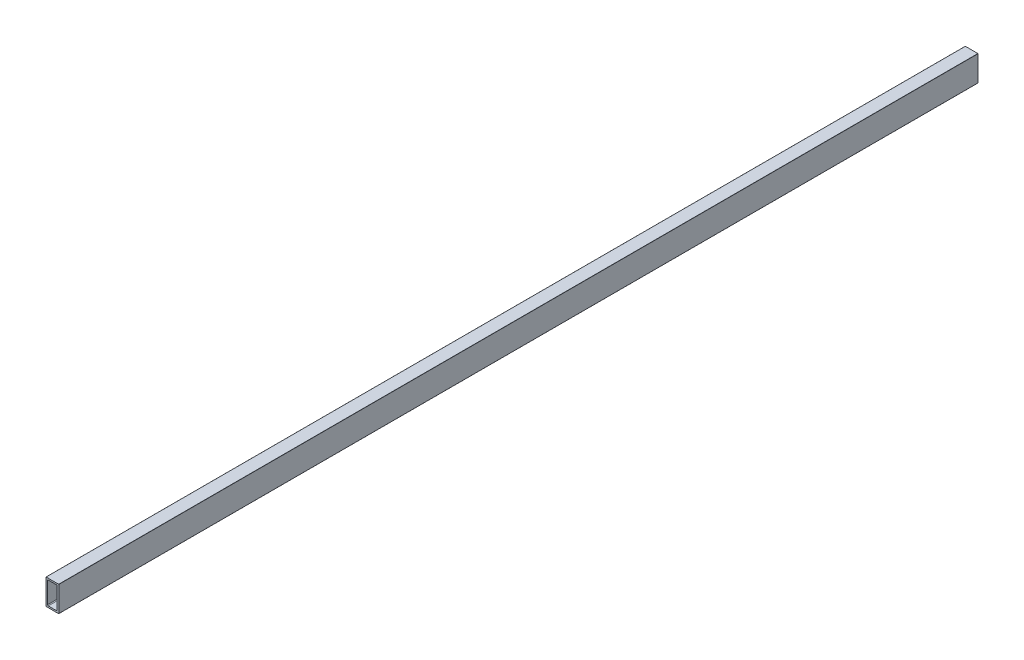
ISO-10303-21;
HEADER;
FILE_DESCRIPTION(('STEP AP214'),'2;1');
FILE_NAME('part.step','',(''),(''),'','','');
FILE_SCHEMA(('AUTOMOTIVE_DESIGN { 1 0 10303 214 1 1 1 1 }'));
ENDSEC;
DATA;
#1=APPLICATION_CONTEXT('core data for automotive mechanical design processes');
#2=APPLICATION_PROTOCOL_DEFINITION('international standard','automotive_design',2000,#1);
#3=PRODUCT_CONTEXT('',#1,'mechanical');
#4=PRODUCT('Part','Part','',(#3));
#5=PRODUCT_RELATED_PRODUCT_CATEGORY('part','',(#4));
#6=PRODUCT_DEFINITION_FORMATION('','',#4);
#7=PRODUCT_DEFINITION_CONTEXT('part definition',#1,'design');
#8=PRODUCT_DEFINITION('design','',#6,#7);
#9=PRODUCT_DEFINITION_SHAPE('','',#8);
#10=(LENGTH_UNIT() NAMED_UNIT(*) SI_UNIT(.MILLI.,.METRE.));
#11=(NAMED_UNIT(*) PLANE_ANGLE_UNIT() SI_UNIT($,.RADIAN.));
#12=(NAMED_UNIT(*) SI_UNIT($,.STERADIAN.) SOLID_ANGLE_UNIT());
#13=UNCERTAINTY_MEASURE_WITH_UNIT(LENGTH_MEASURE(1.E-05),#10,'distance_accuracy_value','');
#14=(GEOMETRIC_REPRESENTATION_CONTEXT(3) GLOBAL_UNCERTAINTY_ASSIGNED_CONTEXT((#13)) GLOBAL_UNIT_ASSIGNED_CONTEXT((#10,
#11,#12)) REPRESENTATION_CONTEXT('',''));
#15=CARTESIAN_POINT('',(0.,0.,0.));
#16=DIRECTION('',(0.,0.,1.));
#17=DIRECTION('',(1.,0.,0.));
#18=AXIS2_PLACEMENT_3D('',#15,#16,#17);
#19=CARTESIAN_POINT('',(3.175,4.7625,1828.8));
#20=DIRECTION('',(1.,0.,0.));
#21=DIRECTION('',(0.,1.,0.));
#22=AXIS2_PLACEMENT_3D('',#19,#20,#21);
#23=PLANE('',#22);
#24=DIRECTION('',(0.,-1.,0.));
#25=VECTOR('',#24,1.);
#26=CARTESIAN_POINT('',(3.175,4.7625,0.));
#27=LINE('',#26,#25);
#28=CARTESIAN_POINT('',(3.175,46.0375,0.));
#29=VERTEX_POINT('',#28);
#30=CARTESIAN_POINT('',(3.175,4.7625,0.));
#31=VERTEX_POINT('',#30);
#32=EDGE_CURVE('E246',#29,#31,#27,.T.);
#33=ORIENTED_EDGE('',*,*,#32,.F.);
#34=DIRECTION('',(0.,0.,-1.));
#35=VECTOR('',#34,1.);
#36=CARTESIAN_POINT('',(3.175,46.0375,1828.8));
#37=LINE('',#36,#35);
#38=CARTESIAN_POINT('',(3.175,46.0375,1828.8));
#39=VERTEX_POINT('',#38);
#40=EDGE_CURVE('E10',#39,#29,#37,.T.);
#41=ORIENTED_EDGE('',*,*,#40,.F.);
#42=DIRECTION('',(0.,-1.,0.));
#43=VECTOR('',#42,1.);
#44=CARTESIAN_POINT('',(3.175,4.7625,1828.8));
#45=LINE('',#44,#43);
#46=CARTESIAN_POINT('',(3.175,4.7625,1828.8));
#47=VERTEX_POINT('',#46);
#48=EDGE_CURVE('E224',#39,#47,#45,.T.);
#49=ORIENTED_EDGE('',*,*,#48,.T.);
#50=DIRECTION('',(0.,0.,-1.));
#51=VECTOR('',#50,1.);
#52=CARTESIAN_POINT('',(3.175,4.7625,1828.8));
#53=LINE('',#52,#51);
#54=EDGE_CURVE('E265',#47,#31,#53,.T.);
#55=ORIENTED_EDGE('',*,*,#54,.T.);
#56=EDGE_LOOP('',(#33,#41,#49,#55));
#57=FACE_BOUND('',#56,.T.);
#58=ADVANCED_FACE('F16',(#57),#23,.T.);
#59=CARTESIAN_POINT('',(4.7625,46.0375,1828.8));
#60=DIRECTION('',(0.,0.,-1.));
#61=DIRECTION('',(-1.,0.,0.));
#62=AXIS2_PLACEMENT_3D('',#59,#60,#61);
#63=CYLINDRICAL_SURFACE('',#62,1.5875);
#64=CARTESIAN_POINT('',(4.7625,46.0375,0.));
#65=DIRECTION('',(0.,0.,1.));
#66=DIRECTION('',(-1.,0.,0.));
#67=AXIS2_PLACEMENT_3D('',#64,#65,#66);
#68=CIRCLE('',#67,1.5875);
#69=CARTESIAN_POINT('',(4.7625,47.625,0.));
#70=VERTEX_POINT('',#69);
#71=EDGE_CURVE('E251',#70,#29,#68,.T.);
#72=ORIENTED_EDGE('',*,*,#71,.F.);
#73=DIRECTION('',(0.,0.,-1.));
#74=VECTOR('',#73,1.);
#75=CARTESIAN_POINT('',(4.7625,47.625,1828.8));
#76=LINE('',#75,#74);
#77=CARTESIAN_POINT('',(4.7625,47.625,1828.8));
#78=VERTEX_POINT('',#77);
#79=EDGE_CURVE('E26',#78,#70,#76,.T.);
#80=ORIENTED_EDGE('',*,*,#79,.F.);
#81=CARTESIAN_POINT('',(4.7625,46.0375,1828.8));
#82=DIRECTION('',(0.,0.,1.));
#83=DIRECTION('',(-1.,0.,0.));
#84=AXIS2_PLACEMENT_3D('',#81,#82,#83);
#85=CIRCLE('',#84,1.5875);
#86=EDGE_CURVE('E215',#78,#39,#85,.T.);
#87=ORIENTED_EDGE('',*,*,#86,.T.);
#88=ORIENTED_EDGE('',*,*,#40,.T.);
#89=EDGE_LOOP('',(#72,#80,#87,#88));
#90=FACE_BOUND('',#89,.T.);
#91=ADVANCED_FACE('F704',(#90),#63,.F.);
#92=CARTESIAN_POINT('',(4.7625,47.625,1828.8));
#93=DIRECTION('',(0.,-1.,0.));
#94=DIRECTION('',(0.,0.,-1.));
#95=AXIS2_PLACEMENT_3D('',#92,#93,#94);
#96=PLANE('',#95);
#97=DIRECTION('',(-1.,0.,0.));
#98=VECTOR('',#97,1.);
#99=CARTESIAN_POINT('',(4.7625,47.625,0.));
#100=LINE('',#99,#98);
#101=CARTESIAN_POINT('',(20.6375,47.625,0.));
#102=VERTEX_POINT('',#101);
#103=EDGE_CURVE('E189',#102,#70,#100,.T.);
#104=ORIENTED_EDGE('',*,*,#103,.F.);
#105=DIRECTION('',(0.,0.,-1.));
#106=VECTOR('',#105,1.);
#107=CARTESIAN_POINT('',(20.6375,47.625,1828.8));
#108=LINE('',#107,#106);
#109=CARTESIAN_POINT('',(20.6375,47.625,1828.8));
#110=VERTEX_POINT('',#109);
#111=EDGE_CURVE('E181',#110,#102,#108,.T.);
#112=ORIENTED_EDGE('',*,*,#111,.F.);
#113=DIRECTION('',(-1.,0.,0.));
#114=VECTOR('',#113,1.);
#115=CARTESIAN_POINT('',(4.7625,47.625,1828.8));
#116=LINE('',#115,#114);
#117=EDGE_CURVE('E212',#110,#78,#116,.T.);
#118=ORIENTED_EDGE('',*,*,#117,.T.);
#119=ORIENTED_EDGE('',*,*,#79,.T.);
#120=EDGE_LOOP('',(#104,#112,#118,#119));
#121=FACE_BOUND('',#120,.T.);
#122=ADVANCED_FACE('F700',(#121),#96,.T.);
#123=CARTESIAN_POINT('',(20.6375,46.0375,1828.8));
#124=DIRECTION('',(0.,0.,-1.));
#125=DIRECTION('',(-1.,0.,0.));
#126=AXIS2_PLACEMENT_3D('',#123,#124,#125);
#127=CYLINDRICAL_SURFACE('',#126,1.5875);
#128=CARTESIAN_POINT('',(20.6375,46.0375,0.));
#129=DIRECTION('',(0.,0.,1.));
#130=DIRECTION('',(-1.,0.,0.));
#131=AXIS2_PLACEMENT_3D('',#128,#129,#130);
#132=CIRCLE('',#131,1.5875);
#133=CARTESIAN_POINT('',(22.225,46.0375,0.));
#134=VERTEX_POINT('',#133);
#135=EDGE_CURVE('E184',#134,#102,#132,.T.);
#136=ORIENTED_EDGE('',*,*,#135,.F.);
#137=DIRECTION('',(0.,0.,-1.));
#138=VECTOR('',#137,1.);
#139=CARTESIAN_POINT('',(22.225,46.0375,1828.8));
#140=LINE('',#139,#138);
#141=CARTESIAN_POINT('',(22.225,46.0375,1828.8));
#142=VERTEX_POINT('',#141);
#143=EDGE_CURVE('E169',#142,#134,#140,.T.);
#144=ORIENTED_EDGE('',*,*,#143,.F.);
#145=CARTESIAN_POINT('',(20.6375,46.0375,1828.8));
#146=DIRECTION('',(0.,0.,1.));
#147=DIRECTION('',(-1.,0.,0.));
#148=AXIS2_PLACEMENT_3D('',#145,#146,#147);
#149=CIRCLE('',#148,1.5875);
#150=EDGE_CURVE('E214',#142,#110,#149,.T.);
#151=ORIENTED_EDGE('',*,*,#150,.T.);
#152=ORIENTED_EDGE('',*,*,#111,.T.);
#153=EDGE_LOOP('',(#136,#144,#151,#152));
#154=FACE_BOUND('',#153,.T.);
#155=ADVANCED_FACE('F185',(#154),#127,.F.);
#156=CARTESIAN_POINT('',(22.225,4.7625,1828.8));
#157=DIRECTION('',(-1.,0.,0.));
#158=DIRECTION('',(0.,0.,1.));
#159=AXIS2_PLACEMENT_3D('',#156,#157,#158);
#160=PLANE('',#159);
#161=DIRECTION('',(0.,1.,0.));
#162=VECTOR('',#161,1.);
#163=CARTESIAN_POINT('',(22.225,4.7625,0.));
#164=LINE('',#163,#162);
#165=CARTESIAN_POINT('',(22.225,4.7625,0.));
#166=VERTEX_POINT('',#165);
#167=EDGE_CURVE('E173',#166,#134,#164,.T.);
#168=ORIENTED_EDGE('',*,*,#167,.F.);
#169=DIRECTION('',(0.,0.,-1.));
#170=VECTOR('',#169,1.);
#171=CARTESIAN_POINT('',(22.225,4.7625,1828.8));
#172=LINE('',#171,#170);
#173=CARTESIAN_POINT('',(22.225,4.7625,1828.8));
#174=VERTEX_POINT('',#173);
#175=EDGE_CURVE('E161',#174,#166,#172,.T.);
#176=ORIENTED_EDGE('',*,*,#175,.F.);
#177=DIRECTION('',(0.,1.,0.));
#178=VECTOR('',#177,1.);
#179=CARTESIAN_POINT('',(22.225,4.7625,1828.8));
#180=LINE('',#179,#178);
#181=EDGE_CURVE('E176',#174,#142,#180,.T.);
#182=ORIENTED_EDGE('',*,*,#181,.T.);
#183=ORIENTED_EDGE('',*,*,#143,.T.);
#184=EDGE_LOOP('',(#168,#176,#182,#183));
#185=FACE_BOUND('',#184,.T.);
#186=ADVANCED_FACE('F171',(#185),#160,.T.);
#187=CARTESIAN_POINT('',(20.6375,4.7625,1828.8));
#188=DIRECTION('',(0.,0.,-1.));
#189=DIRECTION('',(-1.,0.,0.));
#190=AXIS2_PLACEMENT_3D('',#187,#188,#189);
#191=CYLINDRICAL_SURFACE('',#190,1.5875);
#192=CARTESIAN_POINT('',(20.6375,4.7625,0.));
#193=DIRECTION('',(0.,0.,1.));
#194=DIRECTION('',(-1.,0.,0.));
#195=AXIS2_PLACEMENT_3D('',#192,#193,#194);
#196=CIRCLE('',#195,1.5875);
#197=CARTESIAN_POINT('',(20.6375,3.175,0.));
#198=VERTEX_POINT('',#197);
#199=EDGE_CURVE('E195',#198,#166,#196,.T.);
#200=ORIENTED_EDGE('',*,*,#199,.F.);
#201=DIRECTION('',(0.,0.,-1.));
#202=VECTOR('',#201,1.);
#203=CARTESIAN_POINT('',(20.6375,3.175,1828.8));
#204=LINE('',#203,#202);
#205=CARTESIAN_POINT('',(20.6375,3.175,1828.8));
#206=VERTEX_POINT('',#205);
#207=EDGE_CURVE('E266',#206,#198,#204,.T.);
#208=ORIENTED_EDGE('',*,*,#207,.F.);
#209=CARTESIAN_POINT('',(20.6375,4.7625,1828.8));
#210=DIRECTION('',(0.,0.,1.));
#211=DIRECTION('',(-1.,0.,0.));
#212=AXIS2_PLACEMENT_3D('',#209,#210,#211);
#213=CIRCLE('',#212,1.5875);
#214=EDGE_CURVE('E257',#206,#174,#213,.T.);
#215=ORIENTED_EDGE('',*,*,#214,.T.);
#216=ORIENTED_EDGE('',*,*,#175,.T.);
#217=EDGE_LOOP('',(#200,#208,#215,#216));
#218=FACE_BOUND('',#217,.T.);
#219=ADVANCED_FACE('F610',(#218),#191,.F.);
#220=CARTESIAN_POINT('',(4.7625,3.175,1828.8));
#221=DIRECTION('',(0.,1.,0.));
#222=DIRECTION('',(1.,0.,0.));
#223=AXIS2_PLACEMENT_3D('',#220,#221,#222);
#224=PLANE('',#223);
#225=DIRECTION('',(1.,0.,0.));
#226=VECTOR('',#225,1.);
#227=CARTESIAN_POINT('',(4.7625,3.175,0.));
#228=LINE('',#227,#226);
#229=CARTESIAN_POINT('',(4.7625,3.175,0.));
#230=VERTEX_POINT('',#229);
#231=EDGE_CURVE('E202',#230,#198,#228,.T.);
#232=ORIENTED_EDGE('',*,*,#231,.F.);
#233=DIRECTION('',(0.,0.,-1.));
#234=VECTOR('',#233,1.);
#235=CARTESIAN_POINT('',(4.7625,3.175,1828.8));
#236=LINE('',#235,#234);
#237=CARTESIAN_POINT('',(4.7625,3.175,1828.8));
#238=VERTEX_POINT('',#237);
#239=EDGE_CURVE('E269',#238,#230,#236,.T.);
#240=ORIENTED_EDGE('',*,*,#239,.F.);
#241=DIRECTION('',(1.,0.,0.));
#242=VECTOR('',#241,1.);
#243=CARTESIAN_POINT('',(4.7625,3.175,1828.8));
#244=LINE('',#243,#242);
#245=EDGE_CURVE('E321',#238,#206,#244,.T.);
#246=ORIENTED_EDGE('',*,*,#245,.T.);
#247=ORIENTED_EDGE('',*,*,#207,.T.);
#248=EDGE_LOOP('',(#232,#240,#246,#247));
#249=FACE_BOUND('',#248,.T.);
#250=ADVANCED_FACE('F683',(#249),#224,.T.);
#251=CARTESIAN_POINT('',(4.7625,4.7625,1828.8));
#252=DIRECTION('',(0.,0.,-1.));
#253=DIRECTION('',(-1.,0.,0.));
#254=AXIS2_PLACEMENT_3D('',#251,#252,#253);
#255=CYLINDRICAL_SURFACE('',#254,1.5875);
#256=CARTESIAN_POINT('',(4.7625,4.7625,0.));
#257=DIRECTION('',(0.,0.,1.));
#258=DIRECTION('',(1.,0.,0.));
#259=AXIS2_PLACEMENT_3D('',#256,#257,#258);
#260=CIRCLE('',#259,1.5875);
#261=EDGE_CURVE('E248',#31,#230,#260,.T.);
#262=ORIENTED_EDGE('',*,*,#261,.F.);
#263=ORIENTED_EDGE('',*,*,#54,.F.);
#264=CARTESIAN_POINT('',(4.7625,4.7625,1828.8));
#265=DIRECTION('',(0.,0.,1.));
#266=DIRECTION('',(1.,0.,0.));
#267=AXIS2_PLACEMENT_3D('',#264,#265,#266);
#268=CIRCLE('',#267,1.5875);
#269=EDGE_CURVE('E232',#47,#238,#268,.T.);
#270=ORIENTED_EDGE('',*,*,#269,.T.);
#271=ORIENTED_EDGE('',*,*,#239,.T.);
#272=EDGE_LOOP('',(#262,#263,#270,#271));
#273=FACE_BOUND('',#272,.T.);
#274=ADVANCED_FACE('F672',(#273),#255,.F.);
#275=CARTESIAN_POINT('',(0.,0.254,1828.8));
#276=DIRECTION('',(1.,0.,0.));
#277=DIRECTION('',(0.,1.,0.));
#278=AXIS2_PLACEMENT_3D('',#275,#276,#277);
#279=PLANE('',#278);
#280=DIRECTION('',(0.,-1.,0.));
#281=VECTOR('',#280,1.);
#282=CARTESIAN_POINT('',(0.,0.254,0.));
#283=LINE('',#282,#281);
#284=CARTESIAN_POINT('',(0.,50.546,0.));
#285=VERTEX_POINT('',#284);
#286=CARTESIAN_POINT('',(0.,0.254,0.));
#287=VERTEX_POINT('',#286);
#288=EDGE_CURVE('E270',#285,#287,#283,.T.);
#289=ORIENTED_EDGE('',*,*,#288,.T.);
#290=DIRECTION('',(0.,0.,-1.));
#291=VECTOR('',#290,1.);
#292=CARTESIAN_POINT('',(0.,0.254,1828.8));
#293=LINE('',#292,#291);
#294=CARTESIAN_POINT('',(0.,0.254,1828.8));
#295=VERTEX_POINT('',#294);
#296=EDGE_CURVE('E278',#295,#287,#293,.T.);
#297=ORIENTED_EDGE('',*,*,#296,.F.);
#298=DIRECTION('',(0.,-1.,0.));
#299=VECTOR('',#298,1.);
#300=CARTESIAN_POINT('',(0.,0.254,1828.8));
#301=LINE('',#300,#299);
#302=CARTESIAN_POINT('',(0.,50.546,1828.8));
#303=VERTEX_POINT('',#302);
#304=EDGE_CURVE('E289',#303,#295,#301,.T.);
#305=ORIENTED_EDGE('',*,*,#304,.F.);
#306=DIRECTION('',(0.,0.,-1.));
#307=VECTOR('',#306,1.);
#308=CARTESIAN_POINT('',(0.,50.546,1828.8));
#309=LINE('',#308,#307);
#310=EDGE_CURVE('E262',#303,#285,#309,.T.);
#311=ORIENTED_EDGE('',*,*,#310,.T.);
#312=EDGE_LOOP('',(#289,#297,#305,#311));
#313=FACE_BOUND('',#312,.T.);
#314=ADVANCED_FACE('F661',(#313),#279,.F.);
#315=CARTESIAN_POINT('',(0.254,50.546,1828.8));
#316=DIRECTION('',(0.,0.,-1.));
#317=DIRECTION('',(-1.,0.,0.));
#318=AXIS2_PLACEMENT_3D('',#315,#316,#317);
#319=CYLINDRICAL_SURFACE('',#318,0.253999999999995);
#320=CARTESIAN_POINT('',(0.254,50.546,0.));
#321=DIRECTION('',(0.,0.,1.));
#322=DIRECTION('',(-1.,0.,0.));
#323=AXIS2_PLACEMENT_3D('',#320,#321,#322);
#324=CIRCLE('',#323,0.253999999999995);
#325=CARTESIAN_POINT('',(0.254,50.8,0.));
#326=VERTEX_POINT('',#325);
#327=EDGE_CURVE('E274',#326,#285,#324,.T.);
#328=ORIENTED_EDGE('',*,*,#327,.T.);
#329=ORIENTED_EDGE('',*,*,#310,.F.);
#330=CARTESIAN_POINT('',(0.254,50.546,1828.8));
#331=DIRECTION('',(0.,0.,1.));
#332=DIRECTION('',(-1.,0.,0.));
#333=AXIS2_PLACEMENT_3D('',#330,#331,#332);
#334=CIRCLE('',#333,0.253999999999995);
#335=CARTESIAN_POINT('',(0.254,50.8,1828.8));
#336=VERTEX_POINT('',#335);
#337=EDGE_CURVE('E302',#336,#303,#334,.T.);
#338=ORIENTED_EDGE('',*,*,#337,.F.);
#339=DIRECTION('',(0.,0.,-1.));
#340=VECTOR('',#339,1.);
#341=CARTESIAN_POINT('',(0.254,50.8,1828.8));
#342=LINE('',#341,#340);
#343=EDGE_CURVE('E259',#336,#326,#342,.T.);
#344=ORIENTED_EDGE('',*,*,#343,.T.);
#345=EDGE_LOOP('',(#328,#329,#338,#344));
#346=FACE_BOUND('',#345,.T.);
#347=ADVANCED_FACE('F656',(#346),#319,.T.);
#348=CARTESIAN_POINT('',(0.254,50.8,1828.8));
#349=DIRECTION('',(0.,-1.,0.));
#350=DIRECTION('',(0.,0.,-1.));
#351=AXIS2_PLACEMENT_3D('',#348,#349,#350);
#352=PLANE('',#351);
#353=DIRECTION('',(-1.,0.,0.));
#354=VECTOR('',#353,1.);
#355=CARTESIAN_POINT('',(0.254,50.8,0.));
#356=LINE('',#355,#354);
#357=CARTESIAN_POINT('',(25.146,50.8,0.));
#358=VERTEX_POINT('',#357);
#359=EDGE_CURVE('E310',#358,#326,#356,.T.);
#360=ORIENTED_EDGE('',*,*,#359,.T.);
#361=ORIENTED_EDGE('',*,*,#343,.F.);
#362=DIRECTION('',(-1.,0.,0.));
#363=VECTOR('',#362,1.);
#364=CARTESIAN_POINT('',(0.254,50.8,1828.8));
#365=LINE('',#364,#363);
#366=CARTESIAN_POINT('',(25.146,50.8,1828.8));
#367=VERTEX_POINT('',#366);
#368=EDGE_CURVE('E315',#367,#336,#365,.T.);
#369=ORIENTED_EDGE('',*,*,#368,.F.);
#370=DIRECTION('',(0.,0.,-1.));
#371=VECTOR('',#370,1.);
#372=CARTESIAN_POINT('',(25.146,50.8,1828.8));
#373=LINE('',#372,#371);
#374=EDGE_CURVE('E238',#367,#358,#373,.T.);
#375=ORIENTED_EDGE('',*,*,#374,.T.);
#376=EDGE_LOOP('',(#360,#361,#369,#375));
#377=FACE_BOUND('',#376,.T.);
#378=ADVANCED_FACE('F660',(#377),#352,.F.);
#379=CARTESIAN_POINT('',(25.146,50.546,1828.8));
#380=DIRECTION('',(0.,0.,-1.));
#381=DIRECTION('',(-1.,0.,0.));
#382=AXIS2_PLACEMENT_3D('',#379,#380,#381);
#383=CYLINDRICAL_SURFACE('',#382,0.253999999999994);
#384=CARTESIAN_POINT('',(25.146,50.546,0.));
#385=DIRECTION('',(0.,0.,1.));
#386=DIRECTION('',(-1.,0.,0.));
#387=AXIS2_PLACEMENT_3D('',#384,#385,#386);
#388=CIRCLE('',#387,0.253999999999994);
#389=CARTESIAN_POINT('',(25.4,50.546,0.));
#390=VERTEX_POINT('',#389);
#391=EDGE_CURVE('E322',#390,#358,#388,.T.);
#392=ORIENTED_EDGE('',*,*,#391,.T.);
#393=ORIENTED_EDGE('',*,*,#374,.F.);
#394=CARTESIAN_POINT('',(25.146,50.546,1828.8));
#395=DIRECTION('',(0.,0.,1.));
#396=DIRECTION('',(-1.,0.,0.));
#397=AXIS2_PLACEMENT_3D('',#394,#395,#396);
#398=CIRCLE('',#397,0.253999999999994);
#399=CARTESIAN_POINT('',(25.4,50.546,1828.8));
#400=VERTEX_POINT('',#399);
#401=EDGE_CURVE('E311',#400,#367,#398,.T.);
#402=ORIENTED_EDGE('',*,*,#401,.F.);
#403=DIRECTION('',(0.,0.,-1.));
#404=VECTOR('',#403,1.);
#405=CARTESIAN_POINT('',(25.4,50.546,1828.8));
#406=LINE('',#405,#404);
#407=EDGE_CURVE('E235',#400,#390,#406,.T.);
#408=ORIENTED_EDGE('',*,*,#407,.T.);
#409=EDGE_LOOP('',(#392,#393,#402,#408));
#410=FACE_BOUND('',#409,.T.);
#411=ADVANCED_FACE('F366',(#410),#383,.T.);
#412=CARTESIAN_POINT('',(25.4,0.254,1828.8));
#413=DIRECTION('',(-1.,0.,0.));
#414=DIRECTION('',(0.,0.,1.));
#415=AXIS2_PLACEMENT_3D('',#412,#413,#414);
#416=PLANE('',#415);
#417=DIRECTION('',(0.,1.,0.));
#418=VECTOR('',#417,1.);
#419=CARTESIAN_POINT('',(25.4,0.254,0.));
#420=LINE('',#419,#418);
#421=CARTESIAN_POINT('',(25.4,0.254,0.));
#422=VERTEX_POINT('',#421);
#423=EDGE_CURVE('E326',#422,#390,#420,.T.);
#424=ORIENTED_EDGE('',*,*,#423,.T.);
#425=ORIENTED_EDGE('',*,*,#407,.F.);
#426=DIRECTION('',(0.,1.,0.));
#427=VECTOR('',#426,1.);
#428=CARTESIAN_POINT('',(25.4,0.254,1828.8));
#429=LINE('',#428,#427);
#430=CARTESIAN_POINT('',(25.4,0.254,1828.8));
#431=VERTEX_POINT('',#430);
#432=EDGE_CURVE('E210',#431,#400,#429,.T.);
#433=ORIENTED_EDGE('',*,*,#432,.F.);
#434=DIRECTION('',(0.,0.,-1.));
#435=VECTOR('',#434,1.);
#436=CARTESIAN_POINT('',(25.4,0.254,1828.8));
#437=LINE('',#436,#435);
#438=EDGE_CURVE('E19',#431,#422,#437,.T.);
#439=ORIENTED_EDGE('',*,*,#438,.T.);
#440=EDGE_LOOP('',(#424,#425,#433,#439));
#441=FACE_BOUND('',#440,.T.);
#442=ADVANCED_FACE('F358',(#441),#416,.F.);
#443=CARTESIAN_POINT('',(25.146,0.254,1828.8));
#444=DIRECTION('',(0.,0.,-1.));
#445=DIRECTION('',(-1.,0.,0.));
#446=AXIS2_PLACEMENT_3D('',#443,#444,#445);
#447=CYLINDRICAL_SURFACE('',#446,0.254);
#448=CARTESIAN_POINT('',(25.146,0.254,0.));
#449=DIRECTION('',(0.,0.,1.));
#450=DIRECTION('',(1.,0.,0.));
#451=AXIS2_PLACEMENT_3D('',#448,#449,#450);
#452=CIRCLE('',#451,0.254);
#453=CARTESIAN_POINT('',(25.146,0.,0.));
#454=VERTEX_POINT('',#453);
#455=EDGE_CURVE('E306',#454,#422,#452,.T.);
#456=ORIENTED_EDGE('',*,*,#455,.T.);
#457=ORIENTED_EDGE('',*,*,#438,.F.);
#458=CARTESIAN_POINT('',(25.146,0.254,1828.8));
#459=DIRECTION('',(0.,0.,1.));
#460=DIRECTION('',(1.,0.,0.));
#461=AXIS2_PLACEMENT_3D('',#458,#459,#460);
#462=CIRCLE('',#461,0.254);
#463=CARTESIAN_POINT('',(25.146,0.,1828.8));
#464=VERTEX_POINT('',#463);
#465=EDGE_CURVE('E207',#464,#431,#462,.T.);
#466=ORIENTED_EDGE('',*,*,#465,.F.);
#467=DIRECTION('',(0.,0.,-1.));
#468=VECTOR('',#467,1.);
#469=CARTESIAN_POINT('',(25.146,0.,1828.8));
#470=LINE('',#469,#468);
#471=EDGE_CURVE('E281',#464,#454,#470,.T.);
#472=ORIENTED_EDGE('',*,*,#471,.T.);
#473=EDGE_LOOP('',(#456,#457,#466,#472));
#474=FACE_BOUND('',#473,.T.);
#475=ADVANCED_FACE('F373',(#474),#447,.T.);
#476=CARTESIAN_POINT('',(0.254,0.,1828.8));
#477=DIRECTION('',(0.,1.,0.));
#478=DIRECTION('',(1.,0.,0.));
#479=AXIS2_PLACEMENT_3D('',#476,#477,#478);
#480=PLANE('',#479);
#481=DIRECTION('',(1.,0.,0.));
#482=VECTOR('',#481,1.);
#483=CARTESIAN_POINT('',(0.254,0.,0.));
#484=LINE('',#483,#482);
#485=CARTESIAN_POINT('',(0.254,0.,0.));
#486=VERTEX_POINT('',#485);
#487=EDGE_CURVE('E249',#486,#454,#484,.T.);
#488=ORIENTED_EDGE('',*,*,#487,.T.);
#489=ORIENTED_EDGE('',*,*,#471,.F.);
#490=DIRECTION('',(1.,0.,0.));
#491=VECTOR('',#490,1.);
#492=CARTESIAN_POINT('',(0.254,0.,1828.8));
#493=LINE('',#492,#491);
#494=CARTESIAN_POINT('',(0.254,0.,1828.8));
#495=VERTEX_POINT('',#494);
#496=EDGE_CURVE('E211',#495,#464,#493,.T.);
#497=ORIENTED_EDGE('',*,*,#496,.F.);
#498=DIRECTION('',(0.,0.,-1.));
#499=VECTOR('',#498,1.);
#500=CARTESIAN_POINT('',(0.254,0.,1828.8));
#501=LINE('',#500,#499);
#502=EDGE_CURVE('E255',#495,#486,#501,.T.);
#503=ORIENTED_EDGE('',*,*,#502,.T.);
#504=EDGE_LOOP('',(#488,#489,#497,#503));
#505=FACE_BOUND('',#504,.T.);
#506=ADVANCED_FACE('F630',(#505),#480,.F.);
#507=CARTESIAN_POINT('',(0.254,0.254,1828.8));
#508=DIRECTION('',(0.,0.,-1.));
#509=DIRECTION('',(-1.,0.,0.));
#510=AXIS2_PLACEMENT_3D('',#507,#508,#509);
#511=CYLINDRICAL_SURFACE('',#510,0.254);
#512=CARTESIAN_POINT('',(0.254,0.254,0.));
#513=DIRECTION('',(0.,0.,1.));
#514=DIRECTION('',(-1.,0.,0.));
#515=AXIS2_PLACEMENT_3D('',#512,#513,#514);
#516=CIRCLE('',#515,0.254);
#517=EDGE_CURVE('E275',#287,#486,#516,.T.);
#518=ORIENTED_EDGE('',*,*,#517,.T.);
#519=ORIENTED_EDGE('',*,*,#502,.F.);
#520=CARTESIAN_POINT('',(0.254,0.254,1828.8));
#521=DIRECTION('',(0.,0.,1.));
#522=DIRECTION('',(-1.,0.,0.));
#523=AXIS2_PLACEMENT_3D('',#520,#521,#522);
#524=CIRCLE('',#523,0.254);
#525=EDGE_CURVE('E239',#295,#495,#524,.T.);
#526=ORIENTED_EDGE('',*,*,#525,.F.);
#527=ORIENTED_EDGE('',*,*,#296,.T.);
#528=EDGE_LOOP('',(#518,#519,#526,#527));
#529=FACE_BOUND('',#528,.T.);
#530=ADVANCED_FACE('F620',(#529),#511,.T.);
#531=CARTESIAN_POINT('',(0.254,0.254,0.));
#532=DIRECTION('',(0.,0.,-1.));
#533=DIRECTION('',(0.,-1.,0.));
#534=AXIS2_PLACEMENT_3D('',#531,#532,#533);
#535=PLANE('',#534);
#536=ORIENTED_EDGE('',*,*,#32,.T.);
#537=ORIENTED_EDGE('',*,*,#261,.T.);
#538=ORIENTED_EDGE('',*,*,#231,.T.);
#539=ORIENTED_EDGE('',*,*,#199,.T.);
#540=ORIENTED_EDGE('',*,*,#167,.T.);
#541=ORIENTED_EDGE('',*,*,#135,.T.);
#542=ORIENTED_EDGE('',*,*,#103,.T.);
#543=ORIENTED_EDGE('',*,*,#71,.T.);
#544=EDGE_LOOP('',(#536,#537,#538,#539,#540,#541,#542,#543));
#545=FACE_BOUND('',#544,.T.);
#546=ORIENTED_EDGE('',*,*,#517,.F.);
#547=ORIENTED_EDGE('',*,*,#288,.F.);
#548=ORIENTED_EDGE('',*,*,#327,.F.);
#549=ORIENTED_EDGE('',*,*,#359,.F.);
#550=ORIENTED_EDGE('',*,*,#391,.F.);
#551=ORIENTED_EDGE('',*,*,#423,.F.);
#552=ORIENTED_EDGE('',*,*,#455,.F.);
#553=ORIENTED_EDGE('',*,*,#487,.F.);
#554=EDGE_LOOP('',(#546,#547,#548,#549,#550,#551,#552,#553));
#555=FACE_BOUND('',#554,.T.);
#556=ADVANCED_FACE('F192',(#545,#555),#535,.T.);
#557=CARTESIAN_POINT('',(0.254,0.254,1828.8));
#558=DIRECTION('',(0.,0.,-1.));
#559=DIRECTION('',(0.,-1.,0.));
#560=AXIS2_PLACEMENT_3D('',#557,#558,#559);
#561=PLANE('',#560);
#562=ORIENTED_EDGE('',*,*,#269,.F.);
#563=ORIENTED_EDGE('',*,*,#48,.F.);
#564=ORIENTED_EDGE('',*,*,#86,.F.);
#565=ORIENTED_EDGE('',*,*,#117,.F.);
#566=ORIENTED_EDGE('',*,*,#150,.F.);
#567=ORIENTED_EDGE('',*,*,#181,.F.);
#568=ORIENTED_EDGE('',*,*,#214,.F.);
#569=ORIENTED_EDGE('',*,*,#245,.F.);
#570=EDGE_LOOP('',(#562,#563,#564,#565,#566,#567,#568,#569));
#571=FACE_BOUND('',#570,.T.);
#572=ORIENTED_EDGE('',*,*,#525,.T.);
#573=ORIENTED_EDGE('',*,*,#496,.T.);
#574=ORIENTED_EDGE('',*,*,#465,.T.);
#575=ORIENTED_EDGE('',*,*,#432,.T.);
#576=ORIENTED_EDGE('',*,*,#401,.T.);
#577=ORIENTED_EDGE('',*,*,#368,.T.);
#578=ORIENTED_EDGE('',*,*,#337,.T.);
#579=ORIENTED_EDGE('',*,*,#304,.T.);
#580=EDGE_LOOP('',(#572,#573,#574,#575,#576,#577,#578,#579));
#581=FACE_BOUND('',#580,.T.);
#582=ADVANCED_FACE('F369',(#571,#581),#561,.F.);
#583=CLOSED_SHELL('',(#58,#91,#122,#155,#186,#219,#250,#274,#314,#347,#378,#411,#442,#475,#506,
#530,#556,#582));
#584=MANIFOLD_SOLID_BREP('B1',#583);
#585=ADVANCED_BREP_SHAPE_REPRESENTATION('',(#18,#584),#14);
#586=SHAPE_DEFINITION_REPRESENTATION(#9,#585);
ENDSEC;
END-ISO-10303-21;
